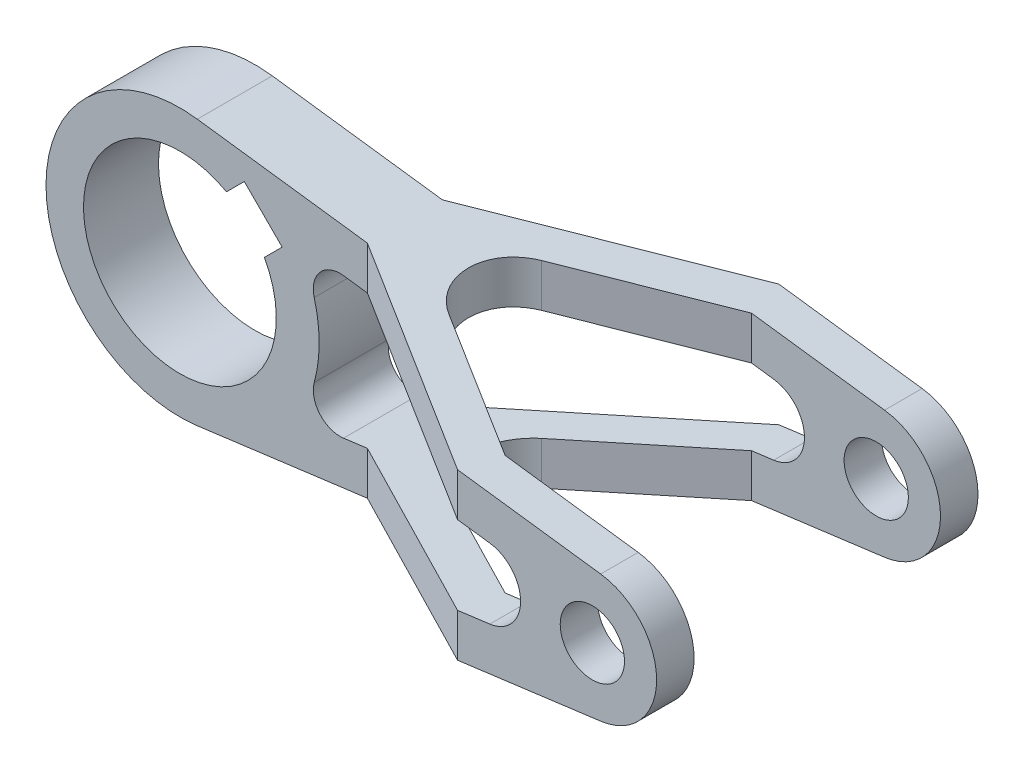
ISO-10303-21;
HEADER;
FILE_DESCRIPTION(('STEP AP214'),'2;1');
FILE_NAME('part.step','',(''),(''),'','','');
FILE_SCHEMA(('AUTOMOTIVE_DESIGN { 1 0 10303 214 1 1 1 1 }'));
ENDSEC;
DATA;
#1=APPLICATION_CONTEXT('core data for automotive mechanical design processes');
#2=APPLICATION_PROTOCOL_DEFINITION('international standard','automotive_design',2000,#1);
#3=PRODUCT_CONTEXT('',#1,'mechanical');
#4=PRODUCT('Part','Part','',(#3));
#5=PRODUCT_RELATED_PRODUCT_CATEGORY('part','',(#4));
#6=PRODUCT_DEFINITION_FORMATION('','',#4);
#7=PRODUCT_DEFINITION_CONTEXT('part definition',#1,'design');
#8=PRODUCT_DEFINITION('design','',#6,#7);
#9=PRODUCT_DEFINITION_SHAPE('','',#8);
#10=(LENGTH_UNIT() NAMED_UNIT(*) SI_UNIT(.MILLI.,.METRE.));
#11=(NAMED_UNIT(*) PLANE_ANGLE_UNIT() SI_UNIT($,.RADIAN.));
#12=(NAMED_UNIT(*) SI_UNIT($,.STERADIAN.) SOLID_ANGLE_UNIT());
#13=UNCERTAINTY_MEASURE_WITH_UNIT(LENGTH_MEASURE(1.E-05),#10,'distance_accuracy_value','');
#14=(GEOMETRIC_REPRESENTATION_CONTEXT(3) GLOBAL_UNCERTAINTY_ASSIGNED_CONTEXT((#13)) GLOBAL_UNIT_ASSIGNED_CONTEXT((#10,
#11,#12)) REPRESENTATION_CONTEXT('',''));
#15=CARTESIAN_POINT('',(0.,0.,0.));
#16=DIRECTION('',(0.,0.,1.));
#17=DIRECTION('',(1.,0.,0.));
#18=AXIS2_PLACEMENT_3D('',#15,#16,#17);
#19=CARTESIAN_POINT('',(80.858,-6.54399235940875,-30.));
#20=DIRECTION('',(0.13,-0.991513993849809,0.));
#21=DIRECTION('',(0.991513993849809,0.13,0.));
#22=AXIS2_PLACEMENT_3D('',#19,#20,#21);
#23=PLANE('',#22);
#24=DIRECTION('',(0.991513993849809,0.13,0.));
#25=VECTOR('',#24,1.);
#26=CARTESIAN_POINT('',(80.858,-6.54399235940875,-7.));
#27=LINE('',#26,#25);
#28=CARTESIAN_POINT('',(30.5506545443114,-13.1399203541781,-7.));
#29=VERTEX_POINT('',#28);
#30=CARTESIAN_POINT('',(35.,-12.5565550029805,-7.00000000000001));
#31=VERTEX_POINT('',#30);
#32=EDGE_CURVE('E457',#29,#31,#27,.T.);
#33=ORIENTED_EDGE('',*,*,#32,.F.);
#34=DIRECTION('',(0.,0.,1.));
#35=VECTOR('',#34,1.);
#36=CARTESIAN_POINT('',(30.5506545443114,-13.1399203541781,-30.));
#37=LINE('',#36,#35);
#38=CARTESIAN_POINT('',(30.5506545443114,-13.1399203541781,7.));
#39=VERTEX_POINT('',#38);
#40=EDGE_CURVE('E372',#29,#39,#37,.T.);
#41=ORIENTED_EDGE('',*,*,#40,.T.);
#42=DIRECTION('',(-0.991513993849809,-0.13,0.));
#43=VECTOR('',#42,1.);
#44=CARTESIAN_POINT('',(80.858,-6.54399235940875,7.));
#45=LINE('',#44,#43);
#46=CARTESIAN_POINT('',(35.,-12.5565550029805,7.));
#47=VERTEX_POINT('',#46);
#48=EDGE_CURVE('E443',#47,#39,#45,.T.);
#49=ORIENTED_EDGE('',*,*,#48,.F.);
#50=DIRECTION('',(-0.860496028858502,-0.112821891012615,-0.496807613898062));
#51=VECTOR('',#50,1.);
#52=CARTESIAN_POINT('',(53.7218928698561,-10.1018785302549,17.8090898881508));
#53=LINE('',#52,#51);
#54=CARTESIAN_POINT('',(74.837168574084,-7.33339935741793,30.));
#55=VERTEX_POINT('',#54);
#56=EDGE_CURVE('E274',#55,#47,#53,.T.);
#57=ORIENTED_EDGE('',*,*,#56,.F.);
#58=DIRECTION('',(0.991513993849809,0.13,0.));
#59=VECTOR('',#58,1.);
#60=CARTESIAN_POINT('',(80.858,-6.54399235940875,30.));
#61=LINE('',#60,#59);
#62=CARTESIAN_POINT('',(80.858,-6.54399235940875,30.));
#63=VERTEX_POINT('',#62);
#64=EDGE_CURVE('E362',#55,#63,#61,.T.);
#65=ORIENTED_EDGE('',*,*,#64,.T.);
#66=DIRECTION('',(0.,0.,1.));
#67=VECTOR('',#66,1.);
#68=CARTESIAN_POINT('',(80.858,-6.54399235940875,-30.));
#69=LINE('',#68,#67);
#70=CARTESIAN_POINT('',(80.858,-6.54399235940875,23.));
#71=VERTEX_POINT('',#70);
#72=EDGE_CURVE('E397',#71,#63,#69,.T.);
#73=ORIENTED_EDGE('',*,*,#72,.F.);
#74=DIRECTION('',(0.991513993849809,0.13,0.));
#75=VECTOR('',#74,1.);
#76=CARTESIAN_POINT('',(80.858,-6.54399235940875,23.));
#77=LINE('',#76,#75);
#78=CARTESIAN_POINT('',(76.7128129211019,-7.08747870816358,23.));
#79=VERTEX_POINT('',#78);
#80=EDGE_CURVE('E446',#79,#71,#77,.T.);
#81=ORIENTED_EDGE('',*,*,#80,.F.);
#82=DIRECTION('',(0.860496028858502,0.112821891012615,0.496807613898062));
#83=VECTOR('',#82,1.);
#84=CARTESIAN_POINT('',(57.1773421430353,-9.64882551405984,11.7211906875371));
#85=LINE('',#84,#83);
#86=CARTESIAN_POINT('',(51.8756443470178,-10.3439450159099,8.66025403784438));
#87=VERTEX_POINT('',#86);
#88=EDGE_CURVE('E448',#87,#79,#85,.T.);
#89=ORIENTED_EDGE('',*,*,#88,.F.);
#90=CARTESIAN_POINT('',(56.8756443470178,-9.68838190330452,0.));
#91=DIRECTION('',(0.13,-0.991513993849809,0.));
#92=DIRECTION('',(-0.991513993849809,-0.13,0.));
#93=AXIS2_PLACEMENT_3D('',#90,#91,#92);
#94=ELLIPSE('',#93,10.0855863477755,10.);
#95=CARTESIAN_POINT('',(51.8756443470178,-10.3439450159099,-8.66025403784438));
#96=VERTEX_POINT('',#95);
#97=EDGE_CURVE('E469',#87,#96,#94,.T.);
#98=ORIENTED_EDGE('',*,*,#97,.T.);
#99=DIRECTION('',(-0.860496028858502,-0.112821891012615,0.496807613898062));
#100=VECTOR('',#99,1.);
#101=CARTESIAN_POINT('',(82.8274008749923,-6.28577904589319,-26.5302590011623));
#102=LINE('',#101,#100);
#103=CARTESIAN_POINT('',(76.7128129211019,-7.08747870816358,-23.));
#104=VERTEX_POINT('',#103);
#105=EDGE_CURVE('E450',#104,#96,#102,.T.);
#106=ORIENTED_EDGE('',*,*,#105,.F.);
#107=DIRECTION('',(-0.991513993849809,-0.13,0.));
#108=VECTOR('',#107,1.);
#109=CARTESIAN_POINT('',(80.858,-6.54399235940875,-23.));
#110=LINE('',#109,#108);
#111=CARTESIAN_POINT('',(80.858,-6.54399235940875,-23.));
#112=VERTEX_POINT('',#111);
#113=EDGE_CURVE('E453',#112,#104,#110,.T.);
#114=ORIENTED_EDGE('',*,*,#113,.F.);
#115=CARTESIAN_POINT('',(80.858,-6.54399235940874,-30.));
#116=VERTEX_POINT('',#115);
#117=EDGE_CURVE('E394',#116,#112,#69,.T.);
#118=ORIENTED_EDGE('',*,*,#117,.F.);
#119=DIRECTION('',(0.991513993849809,0.13,0.));
#120=VECTOR('',#119,1.);
#121=CARTESIAN_POINT('',(80.858,-6.54399235940875,-30.));
#122=LINE('',#121,#120);
#123=CARTESIAN_POINT('',(74.837168574084,-7.33339935741793,-30.));
#124=VERTEX_POINT('',#123);
#125=EDGE_CURVE('E363',#124,#116,#122,.T.);
#126=ORIENTED_EDGE('',*,*,#125,.F.);
#127=DIRECTION('',(0.860496028858502,0.112821891012615,-0.496807613898062));
#128=VECTOR('',#127,1.);
#129=CARTESIAN_POINT('',(79.3719516018132,-6.73883206208828,-32.618158201776));
#130=LINE('',#129,#128);
#131=EDGE_CURVE('E455',#31,#124,#130,.T.);
#132=ORIENTED_EDGE('',*,*,#131,.F.);
#133=EDGE_LOOP('',(#33,#41,#49,#57,#65,#73,#81,#89,#98,#106,#114,#118,#126,#132));
#134=FACE_BOUND('',#133,.T.);
#135=ADVANCED_FACE('F37',(#134),#23,.F.);
#136=CARTESIAN_POINT('',(80.,0.,-30.));
#137=DIRECTION('',(0.,0.,1.));
#138=DIRECTION('',(1.,0.,0.));
#139=AXIS2_PLACEMENT_3D('',#136,#137,#138);
#140=CYLINDRICAL_SURFACE('',#139,6.6);
#141=CARTESIAN_POINT('',(80.,0.,23.));
#142=DIRECTION('',(0.,0.,-1.));
#143=DIRECTION('',(-1.,0.,0.));
#144=AXIS2_PLACEMENT_3D('',#141,#142,#143);
#145=CIRCLE('',#144,6.6);
#146=CARTESIAN_POINT('',(80.858,6.54399235940875,23.));
#147=VERTEX_POINT('',#146);
#148=EDGE_CURVE('E284',#71,#147,#145,.F.);
#149=ORIENTED_EDGE('',*,*,#148,.F.);
#150=ORIENTED_EDGE('',*,*,#72,.T.);
#151=CARTESIAN_POINT('',(80.,0.,30.));
#152=DIRECTION('',(0.,0.,1.));
#153=DIRECTION('',(1.,0.,0.));
#154=AXIS2_PLACEMENT_3D('',#151,#152,#153);
#155=CIRCLE('',#154,6.6);
#156=CARTESIAN_POINT('',(80.858,6.54399235940875,30.));
#157=VERTEX_POINT('',#156);
#158=EDGE_CURVE('E375',#63,#157,#155,.T.);
#159=ORIENTED_EDGE('',*,*,#158,.T.);
#160=DIRECTION('',(0.,0.,1.));
#161=VECTOR('',#160,1.);
#162=CARTESIAN_POINT('',(80.858,6.54399235940875,-30.));
#163=LINE('',#162,#161);
#164=EDGE_CURVE('E393',#147,#157,#163,.T.);
#165=ORIENTED_EDGE('',*,*,#164,.F.);
#166=EDGE_LOOP('',(#149,#150,#159,#165));
#167=FACE_BOUND('',#166,.T.);
#168=ADVANCED_FACE('F556',(#167),#140,.F.);
#169=CARTESIAN_POINT('',(80.,0.,-23.));
#170=DIRECTION('',(0.,0.,1.));
#171=DIRECTION('',(1.,0.,0.));
#172=AXIS2_PLACEMENT_3D('',#169,#170,#171);
#173=CIRCLE('',#172,6.6);
#174=CARTESIAN_POINT('',(80.858,6.54399235940875,-23.));
#175=VERTEX_POINT('',#174);
#176=EDGE_CURVE('E317',#175,#112,#173,.F.);
#177=ORIENTED_EDGE('',*,*,#176,.F.);
#178=CARTESIAN_POINT('',(80.858,6.54399235940875,-30.));
#179=VERTEX_POINT('',#178);
#180=EDGE_CURVE('E390',#179,#175,#163,.T.);
#181=ORIENTED_EDGE('',*,*,#180,.F.);
#182=CARTESIAN_POINT('',(80.,0.,-30.));
#183=DIRECTION('',(0.,0.,1.));
#184=DIRECTION('',(1.,0.,0.));
#185=AXIS2_PLACEMENT_3D('',#182,#183,#184);
#186=CIRCLE('',#185,6.6);
#187=EDGE_CURVE('E365',#116,#179,#186,.T.);
#188=ORIENTED_EDGE('',*,*,#187,.F.);
#189=ORIENTED_EDGE('',*,*,#117,.T.);
#190=EDGE_LOOP('',(#177,#181,#188,#189));
#191=FACE_BOUND('',#190,.T.);
#192=ADVANCED_FACE('F604',(#191),#140,.F.);
#193=CARTESIAN_POINT('',(80.858,6.54399235940875,-30.));
#194=DIRECTION('',(0.13,0.991513993849809,0.));
#195=DIRECTION('',(-0.991513993849809,0.13,0.));
#196=AXIS2_PLACEMENT_3D('',#193,#194,#195);
#197=PLANE('',#196);
#198=DIRECTION('',(-0.991513993849809,0.13,0.));
#199=VECTOR('',#198,1.);
#200=CARTESIAN_POINT('',(80.858,6.54399235940875,-7.));
#201=LINE('',#200,#199);
#202=CARTESIAN_POINT('',(35.,12.5565550029805,-7.));
#203=VERTEX_POINT('',#202);
#204=CARTESIAN_POINT('',(30.5506545443114,13.1399203541781,-7.));
#205=VERTEX_POINT('',#204);
#206=EDGE_CURVE('E342',#203,#205,#201,.T.);
#207=ORIENTED_EDGE('',*,*,#206,.F.);
#208=DIRECTION('',(-0.860496028858502,0.112821891012614,0.496807613898062));
#209=VECTOR('',#208,1.);
#210=CARTESIAN_POINT('',(79.3719516018132,6.73883206208828,-32.618158201776));
#211=LINE('',#210,#209);
#212=CARTESIAN_POINT('',(74.837168574084,7.33339935741793,-30.));
#213=VERTEX_POINT('',#212);
#214=EDGE_CURVE('E330',#213,#203,#211,.T.);
#215=ORIENTED_EDGE('',*,*,#214,.F.);
#216=DIRECTION('',(-0.991513993849809,0.13,0.));
#217=VECTOR('',#216,1.);
#218=CARTESIAN_POINT('',(80.858,6.54399235940875,-30.));
#219=LINE('',#218,#217);
#220=EDGE_CURVE('E369',#179,#213,#219,.T.);
#221=ORIENTED_EDGE('',*,*,#220,.F.);
#222=ORIENTED_EDGE('',*,*,#180,.T.);
#223=DIRECTION('',(0.991513993849809,-0.13,0.));
#224=VECTOR('',#223,1.);
#225=CARTESIAN_POINT('',(80.858,6.54399235940875,-23.));
#226=LINE('',#225,#224);
#227=CARTESIAN_POINT('',(76.7128129211019,7.08747870816357,-23.));
#228=VERTEX_POINT('',#227);
#229=EDGE_CURVE('E319',#228,#175,#226,.T.);
#230=ORIENTED_EDGE('',*,*,#229,.F.);
#231=DIRECTION('',(0.860496028858502,-0.112821891012614,-0.496807613898062));
#232=VECTOR('',#231,1.);
#233=CARTESIAN_POINT('',(82.8274008749923,6.28577904589319,-26.5302590011623));
#234=LINE('',#233,#232);
#235=CARTESIAN_POINT('',(51.8756443470178,10.3439450159099,-8.66025403784438));
#236=VERTEX_POINT('',#235);
#237=EDGE_CURVE('E311',#236,#228,#234,.T.);
#238=ORIENTED_EDGE('',*,*,#237,.F.);
#239=CARTESIAN_POINT('',(56.8756443470178,9.68838190330451,0.));
#240=DIRECTION('',(0.13,0.991513993849809,0.));
#241=DIRECTION('',(0.991513993849809,-0.13,0.));
#242=AXIS2_PLACEMENT_3D('',#239,#240,#241);
#243=ELLIPSE('',#242,10.0855863477755,10.);
#244=CARTESIAN_POINT('',(51.8756443470178,10.3439450159099,8.66025403784438));
#245=VERTEX_POINT('',#244);
#246=EDGE_CURVE('E12',#236,#245,#243,.T.);
#247=ORIENTED_EDGE('',*,*,#246,.T.);
#248=DIRECTION('',(-0.860496028858502,0.112821891012614,-0.496807613898062));
#249=VECTOR('',#248,1.);
#250=CARTESIAN_POINT('',(57.1773421430353,9.64882551405984,11.7211906875371));
#251=LINE('',#250,#249);
#252=CARTESIAN_POINT('',(76.7128129211019,7.08747870816358,23.));
#253=VERTEX_POINT('',#252);
#254=EDGE_CURVE('E303',#253,#245,#251,.T.);
#255=ORIENTED_EDGE('',*,*,#254,.F.);
#256=DIRECTION('',(-0.991513993849809,0.13,0.));
#257=VECTOR('',#256,1.);
#258=CARTESIAN_POINT('',(80.858,6.54399235940875,23.));
#259=LINE('',#258,#257);
#260=EDGE_CURVE('E287',#147,#253,#259,.T.);
#261=ORIENTED_EDGE('',*,*,#260,.F.);
#262=ORIENTED_EDGE('',*,*,#164,.T.);
#263=DIRECTION('',(-0.991513993849809,0.13,0.));
#264=VECTOR('',#263,1.);
#265=CARTESIAN_POINT('',(80.858,6.54399235940875,30.));
#266=LINE('',#265,#264);
#267=CARTESIAN_POINT('',(74.837168574084,7.33339935741793,30.));
#268=VERTEX_POINT('',#267);
#269=EDGE_CURVE('E366',#157,#268,#266,.T.);
#270=ORIENTED_EDGE('',*,*,#269,.T.);
#271=DIRECTION('',(0.860496028858502,-0.112821891012614,0.496807613898062));
#272=VECTOR('',#271,1.);
#273=CARTESIAN_POINT('',(53.7218928698561,10.1018785302549,17.8090898881508));
#274=LINE('',#273,#272);
#275=CARTESIAN_POINT('',(35.,12.5565550029805,7.));
#276=VERTEX_POINT('',#275);
#277=EDGE_CURVE('E267',#276,#268,#274,.T.);
#278=ORIENTED_EDGE('',*,*,#277,.F.);
#279=DIRECTION('',(0.991513993849809,-0.13,0.));
#280=VECTOR('',#279,1.);
#281=CARTESIAN_POINT('',(80.858,6.54399235940875,7.));
#282=LINE('',#281,#280);
#283=CARTESIAN_POINT('',(30.5506545443114,13.1399203541781,7.));
#284=VERTEX_POINT('',#283);
#285=EDGE_CURVE('E520',#284,#276,#282,.T.);
#286=ORIENTED_EDGE('',*,*,#285,.F.);
#287=DIRECTION('',(0.,0.,1.));
#288=VECTOR('',#287,1.);
#289=CARTESIAN_POINT('',(30.5506545443114,13.1399203541781,-30.));
#290=LINE('',#289,#288);
#291=EDGE_CURVE('E387',#205,#284,#290,.T.);
#292=ORIENTED_EDGE('',*,*,#291,.F.);
#293=EDGE_LOOP('',(#207,#215,#221,#222,#230,#238,#247,#255,#261,#262,#270,#278,#286,#292));
#294=FACE_BOUND('',#293,.T.);
#295=ADVANCED_FACE('F550',(#294),#197,.F.);
#296=CARTESIAN_POINT('',(29.9006545443114,8.18235038492903,-30.));
#297=DIRECTION('',(0.,0.,1.));
#298=DIRECTION('',(1.,0.,0.));
#299=AXIS2_PLACEMENT_3D('',#296,#297,#298);
#300=CYLINDRICAL_SURFACE('',#299,5.);
#301=CARTESIAN_POINT('',(29.9006545443114,8.18235038492903,-7.));
#302=DIRECTION('',(0.,0.,-1.));
#303=DIRECTION('',(-1.,0.,0.));
#304=AXIS2_PLACEMENT_3D('',#301,#302,#303);
#305=CIRCLE('',#304,5.);
#306=CARTESIAN_POINT('',(25.077968327487,6.86261645187597,-7.));
#307=VERTEX_POINT('',#306);
#308=EDGE_CURVE('E340',#205,#307,#305,.F.);
#309=ORIENTED_EDGE('',*,*,#308,.F.);
#310=ORIENTED_EDGE('',*,*,#291,.T.);
#311=CARTESIAN_POINT('',(29.9006545443114,8.18235038492903,7.));
#312=DIRECTION('',(0.,0.,1.));
#313=DIRECTION('',(1.,0.,0.));
#314=AXIS2_PLACEMENT_3D('',#311,#312,#313);
#315=CIRCLE('',#314,5.);
#316=CARTESIAN_POINT('',(25.077968327487,6.86261645187597,7.));
#317=VERTEX_POINT('',#316);
#318=EDGE_CURVE('E518',#317,#284,#315,.F.);
#319=ORIENTED_EDGE('',*,*,#318,.F.);
#320=DIRECTION('',(0.,0.,1.));
#321=VECTOR('',#320,1.);
#322=CARTESIAN_POINT('',(25.077968327487,6.86261645187597,-30.));
#323=LINE('',#322,#321);
#324=EDGE_CURVE('E384',#307,#317,#323,.T.);
#325=ORIENTED_EDGE('',*,*,#324,.F.);
#326=EDGE_LOOP('',(#309,#310,#319,#325));
#327=FACE_BOUND('',#326,.T.);
#328=ADVANCED_FACE('F573',(#327),#300,.F.);
#329=CARTESIAN_POINT('',(0.,0.,-30.));
#330=DIRECTION('',(0.,0.,1.));
#331=DIRECTION('',(1.,0.,0.));
#332=AXIS2_PLACEMENT_3D('',#329,#330,#331);
#333=CYLINDRICAL_SURFACE('',#332,26.);
#334=CARTESIAN_POINT('',(0.,0.,-7.));
#335=DIRECTION('',(0.,0.,-1.));
#336=DIRECTION('',(-1.,0.,0.));
#337=AXIS2_PLACEMENT_3D('',#334,#335,#336);
#338=CIRCLE('',#337,26.);
#339=CARTESIAN_POINT('',(25.077968327487,-6.86261645187597,-7.));
#340=VERTEX_POINT('',#339);
#341=EDGE_CURVE('E338',#307,#340,#338,.T.);
#342=ORIENTED_EDGE('',*,*,#341,.F.);
#343=ORIENTED_EDGE('',*,*,#324,.T.);
#344=CARTESIAN_POINT('',(0.,0.,7.));
#345=DIRECTION('',(0.,0.,1.));
#346=DIRECTION('',(1.,0.,0.));
#347=AXIS2_PLACEMENT_3D('',#344,#345,#346);
#348=CIRCLE('',#347,26.);
#349=CARTESIAN_POINT('',(25.077968327487,-6.86261645187597,7.));
#350=VERTEX_POINT('',#349);
#351=EDGE_CURVE('E515',#350,#317,#348,.T.);
#352=ORIENTED_EDGE('',*,*,#351,.F.);
#353=DIRECTION('',(0.,0.,1.));
#354=VECTOR('',#353,1.);
#355=CARTESIAN_POINT('',(25.077968327487,-6.86261645187597,-30.));
#356=LINE('',#355,#354);
#357=EDGE_CURVE('E380',#340,#350,#356,.T.);
#358=ORIENTED_EDGE('',*,*,#357,.F.);
#359=EDGE_LOOP('',(#342,#343,#352,#358));
#360=FACE_BOUND('',#359,.T.);
#361=ADVANCED_FACE('F568',(#360),#333,.T.);
#362=CARTESIAN_POINT('',(29.9006545443114,-8.18235038492904,-30.));
#363=DIRECTION('',(0.,0.,1.));
#364=DIRECTION('',(1.,0.,0.));
#365=AXIS2_PLACEMENT_3D('',#362,#363,#364);
#366=CYLINDRICAL_SURFACE('',#365,5.);
#367=CARTESIAN_POINT('',(29.9006545443114,-8.18235038492904,-7.));
#368=DIRECTION('',(0.,0.,-1.));
#369=DIRECTION('',(-1.,0.,0.));
#370=AXIS2_PLACEMENT_3D('',#367,#368,#369);
#371=CIRCLE('',#370,5.);
#372=EDGE_CURVE('E336',#340,#29,#371,.F.);
#373=ORIENTED_EDGE('',*,*,#372,.F.);
#374=ORIENTED_EDGE('',*,*,#357,.T.);
#375=CARTESIAN_POINT('',(29.9006545443114,-8.18235038492904,7.));
#376=DIRECTION('',(0.,0.,1.));
#377=DIRECTION('',(1.,0.,0.));
#378=AXIS2_PLACEMENT_3D('',#375,#376,#377);
#379=CIRCLE('',#378,5.);
#380=EDGE_CURVE('E513',#39,#350,#379,.F.);
#381=ORIENTED_EDGE('',*,*,#380,.F.);
#382=ORIENTED_EDGE('',*,*,#40,.F.);
#383=EDGE_LOOP('',(#373,#374,#381,#382));
#384=FACE_BOUND('',#383,.T.);
#385=ADVANCED_FACE('F564',(#384),#366,.F.);
#386=CARTESIAN_POINT('',(3.25,24.7878498462452,30.));
#387=DIRECTION('',(-0.13,-0.991513993849809,0.));
#388=DIRECTION('',(0.99151399384981,-0.13,0.));
#389=AXIS2_PLACEMENT_3D('',#386,#387,#388);
#390=PLANE('',#389);
#391=DIRECTION('',(0.99151399384981,-0.13,0.));
#392=VECTOR('',#391,1.);
#393=CARTESIAN_POINT('',(3.25,24.7878498462452,-7.));
#394=LINE('',#393,#392);
#395=CARTESIAN_POINT('',(3.25,24.7878498462452,-7.));
#396=VERTEX_POINT('',#395);
#397=CARTESIAN_POINT('',(35.,20.6250240812009,-7.));
#398=VERTEX_POINT('',#397);
#399=EDGE_CURVE('E356',#396,#398,#394,.T.);
#400=ORIENTED_EDGE('',*,*,#399,.F.);
#401=DIRECTION('',(0.,0.,-1.));
#402=VECTOR('',#401,1.);
#403=CARTESIAN_POINT('',(3.25,24.7878498462452,30.));
#404=LINE('',#403,#402);
#405=CARTESIAN_POINT('',(3.25,24.7878498462452,7.));
#406=VERTEX_POINT('',#405);
#407=EDGE_CURVE('E425',#406,#396,#404,.T.);
#408=ORIENTED_EDGE('',*,*,#407,.F.);
#409=DIRECTION('',(-0.99151399384981,0.13,0.));
#410=VECTOR('',#409,1.);
#411=CARTESIAN_POINT('',(3.25,24.7878498462452,7.));
#412=LINE('',#411,#410);
#413=CARTESIAN_POINT('',(35.,20.6250240812009,7.));
#414=VERTEX_POINT('',#413);
#415=EDGE_CURVE('E534',#414,#406,#412,.T.);
#416=ORIENTED_EDGE('',*,*,#415,.F.);
#417=DIRECTION('',(-0.860496028858502,0.112821891012614,-0.496807613898062));
#418=VECTOR('',#417,1.);
#419=CARTESIAN_POINT('',(20.9189878298768,22.471222514577,-1.12967616688304));
#420=LINE('',#419,#418);
#421=CARTESIAN_POINT('',(74.837168574084,15.4018684356383,30.));
#422=VERTEX_POINT('',#421);
#423=EDGE_CURVE('E285',#422,#414,#420,.T.);
#424=ORIENTED_EDGE('',*,*,#423,.F.);
#425=DIRECTION('',(-0.991513993849809,0.13,0.));
#426=VECTOR('',#425,1.);
#427=CARTESIAN_POINT('',(3.25,24.7878498462452,30.));
#428=LINE('',#427,#426);
#429=CARTESIAN_POINT('',(101.56,11.8981679261977,30.));
#430=VERTEX_POINT('',#429);
#431=EDGE_CURVE('E422',#430,#422,#428,.T.);
#432=ORIENTED_EDGE('',*,*,#431,.F.);
#433=DIRECTION('',(0.,0.,-1.));
#434=VECTOR('',#433,1.);
#435=CARTESIAN_POINT('',(101.56,11.8981679261977,30.));
#436=LINE('',#435,#434);
#437=CARTESIAN_POINT('',(101.56,11.8981679261977,23.));
#438=VERTEX_POINT('',#437);
#439=EDGE_CURVE('E434',#430,#438,#436,.T.);
#440=ORIENTED_EDGE('',*,*,#439,.T.);
#441=DIRECTION('',(0.99151399384981,-0.13,0.));
#442=VECTOR('',#441,1.);
#443=CARTESIAN_POINT('',(3.25,24.7878498462452,23.));
#444=LINE('',#443,#442);
#445=CARTESIAN_POINT('',(76.7128129211019,15.155947786384,23.));
#446=VERTEX_POINT('',#445);
#447=EDGE_CURVE('E296',#446,#438,#444,.T.);
#448=ORIENTED_EDGE('',*,*,#447,.F.);
#449=DIRECTION('',(0.860496028858502,-0.112821891012614,0.496807613898062));
#450=VECTOR('',#449,1.);
#451=CARTESIAN_POINT('',(24.374437103056,22.0181694983819,-7.21757536749671));
#452=LINE('',#451,#450);
#453=CARTESIAN_POINT('',(51.8756443470178,18.4124140941303,8.66025403784438));
#454=VERTEX_POINT('',#453);
#455=EDGE_CURVE('E306',#454,#446,#452,.T.);
#456=ORIENTED_EDGE('',*,*,#455,.F.);
#457=CARTESIAN_POINT('',(56.8756443470178,17.7568509815249,0.));
#458=DIRECTION('',(-0.13,-0.991513993849809,0.));
#459=DIRECTION('',(0.99151399384981,-0.13,0.));
#460=AXIS2_PLACEMENT_3D('',#457,#458,#459);
#461=ELLIPSE('',#460,10.0855863477755,10.);
#462=CARTESIAN_POINT('',(51.8756443470178,18.4124140941303,-8.66025403784439));
#463=VERTEX_POINT('',#462);
#464=EDGE_CURVE('E45',#454,#463,#461,.T.);
#465=ORIENTED_EDGE('',*,*,#464,.T.);
#466=DIRECTION('',(-0.860496028858502,0.112821891012614,0.496807613898062));
#467=VECTOR('',#466,1.);
#468=CARTESIAN_POINT('',(-1.27562162890099,25.3812159665486,22.0266436811219));
#469=LINE('',#468,#467);
#470=CARTESIAN_POINT('',(76.7128129211019,15.155947786384,-23.));
#471=VERTEX_POINT('',#470);
#472=EDGE_CURVE('E313',#471,#463,#469,.T.);
#473=ORIENTED_EDGE('',*,*,#472,.F.);
#474=DIRECTION('',(-0.99151399384981,0.13,0.));
#475=VECTOR('',#474,1.);
#476=CARTESIAN_POINT('',(3.24999999999999,24.7878498462452,-23.));
#477=LINE('',#476,#475);
#478=CARTESIAN_POINT('',(101.56,11.8981679261977,-23.));
#479=VERTEX_POINT('',#478);
#480=EDGE_CURVE('E324',#479,#471,#477,.T.);
#481=ORIENTED_EDGE('',*,*,#480,.F.);
#482=CARTESIAN_POINT('',(101.56,11.8981679261977,-30.));
#483=VERTEX_POINT('',#482);
#484=EDGE_CURVE('E433',#479,#483,#436,.T.);
#485=ORIENTED_EDGE('',*,*,#484,.T.);
#486=DIRECTION('',(-0.991513993849809,0.13,0.));
#487=VECTOR('',#486,1.);
#488=CARTESIAN_POINT('',(3.25,24.7878498462452,-30.));
#489=LINE('',#488,#487);
#490=CARTESIAN_POINT('',(74.837168574084,15.4018684356383,-30.));
#491=VERTEX_POINT('',#490);
#492=EDGE_CURVE('E420',#483,#491,#489,.T.);
#493=ORIENTED_EDGE('',*,*,#492,.T.);
#494=DIRECTION('',(0.860496028858502,-0.112821891012614,-0.496807613898062));
#495=VECTOR('',#494,1.);
#496=CARTESIAN_POINT('',(-4.73107090208019,25.8342689827437,15.9387444805082));
#497=LINE('',#496,#495);
#498=EDGE_CURVE('E332',#398,#491,#497,.T.);
#499=ORIENTED_EDGE('',*,*,#498,.F.);
#500=EDGE_LOOP('',(#400,#408,#416,#424,#432,#440,#448,#456,#465,#473,#481,#485,#493,#499));
#501=FACE_BOUND('',#500,.T.);
#502=ADVANCED_FACE('F579',(#501),#390,.F.);
#503=CARTESIAN_POINT('',(100.,0.,30.));
#504=DIRECTION('',(0.,0.,-1.));
#505=DIRECTION('',(-1.,0.,0.));
#506=AXIS2_PLACEMENT_3D('',#503,#504,#505);
#507=CYLINDRICAL_SURFACE('',#506,12.);
#508=CARTESIAN_POINT('',(100.,0.,23.));
#509=DIRECTION('',(0.,0.,-1.));
#510=DIRECTION('',(-1.,0.,0.));
#511=AXIS2_PLACEMENT_3D('',#508,#509,#510);
#512=CIRCLE('',#511,12.);
#513=CARTESIAN_POINT('',(101.56,-11.8981679261977,23.));
#514=VERTEX_POINT('',#513);
#515=EDGE_CURVE('E299',#438,#514,#512,.T.);
#516=ORIENTED_EDGE('',*,*,#515,.F.);
#517=ORIENTED_EDGE('',*,*,#439,.F.);
#518=CARTESIAN_POINT('',(100.,0.,30.));
#519=DIRECTION('',(0.,0.,1.));
#520=DIRECTION('',(1.,0.,0.));
#521=AXIS2_PLACEMENT_3D('',#518,#519,#520);
#522=CIRCLE('',#521,12.);
#523=CARTESIAN_POINT('',(101.56,-11.8981679261977,30.));
#524=VERTEX_POINT('',#523);
#525=EDGE_CURVE('E419',#524,#430,#522,.T.);
#526=ORIENTED_EDGE('',*,*,#525,.F.);
#527=DIRECTION('',(0.,0.,-1.));
#528=VECTOR('',#527,1.);
#529=CARTESIAN_POINT('',(101.56,-11.8981679261977,30.));
#530=LINE('',#529,#528);
#531=EDGE_CURVE('E438',#524,#514,#530,.T.);
#532=ORIENTED_EDGE('',*,*,#531,.T.);
#533=EDGE_LOOP('',(#516,#517,#526,#532));
#534=FACE_BOUND('',#533,.T.);
#535=ADVANCED_FACE('F632',(#534),#507,.T.);
#536=ORIENTED_EDGE('',*,*,#484,.F.);
#537=CARTESIAN_POINT('',(100.,0.,-23.));
#538=DIRECTION('',(0.,0.,1.));
#539=DIRECTION('',(1.,0.,0.));
#540=AXIS2_PLACEMENT_3D('',#537,#538,#539);
#541=CIRCLE('',#540,12.);
#542=CARTESIAN_POINT('',(101.56,-11.8981679261977,-23.));
#543=VERTEX_POINT('',#542);
#544=EDGE_CURVE('E326',#543,#479,#541,.T.);
#545=ORIENTED_EDGE('',*,*,#544,.F.);
#546=CARTESIAN_POINT('',(101.56,-11.8981679261977,-30.));
#547=VERTEX_POINT('',#546);
#548=EDGE_CURVE('E437',#543,#547,#530,.T.);
#549=ORIENTED_EDGE('',*,*,#548,.T.);
#550=CARTESIAN_POINT('',(100.,0.,-30.));
#551=DIRECTION('',(0.,0.,1.));
#552=DIRECTION('',(1.,0.,0.));
#553=AXIS2_PLACEMENT_3D('',#550,#551,#552);
#554=CIRCLE('',#553,12.);
#555=EDGE_CURVE('E427',#547,#483,#554,.T.);
#556=ORIENTED_EDGE('',*,*,#555,.T.);
#557=EDGE_LOOP('',(#536,#545,#549,#556));
#558=FACE_BOUND('',#557,.T.);
#559=ADVANCED_FACE('F614',(#558),#507,.T.);
#560=CARTESIAN_POINT('',(3.25,-24.7878498462452,30.));
#561=DIRECTION('',(-0.13,0.991513993849809,0.));
#562=DIRECTION('',(-0.99151399384981,-0.13,0.));
#563=AXIS2_PLACEMENT_3D('',#560,#561,#562);
#564=PLANE('',#563);
#565=DIRECTION('',(-0.99151399384981,-0.13,0.));
#566=VECTOR('',#565,1.);
#567=CARTESIAN_POINT('',(3.25,-24.7878498462452,-7.));
#568=LINE('',#567,#566);
#569=CARTESIAN_POINT('',(35.,-20.6250240812009,-7.));
#570=VERTEX_POINT('',#569);
#571=CARTESIAN_POINT('',(3.25,-24.7878498462452,-7.));
#572=VERTEX_POINT('',#571);
#573=EDGE_CURVE('E360',#570,#572,#568,.T.);
#574=ORIENTED_EDGE('',*,*,#573,.F.);
#575=DIRECTION('',(-0.860496028858502,-0.112821891012614,0.496807613898062));
#576=VECTOR('',#575,1.);
#577=CARTESIAN_POINT('',(-4.73107090208018,-25.8342689827437,15.9387444805082));
#578=LINE('',#577,#576);
#579=CARTESIAN_POINT('',(74.837168574084,-15.4018684356383,-30.));
#580=VERTEX_POINT('',#579);
#581=EDGE_CURVE('E334',#580,#570,#578,.T.);
#582=ORIENTED_EDGE('',*,*,#581,.F.);
#583=DIRECTION('',(0.991513993849809,0.13,0.));
#584=VECTOR('',#583,1.);
#585=CARTESIAN_POINT('',(3.25,-24.7878498462452,-30.));
#586=LINE('',#585,#584);
#587=EDGE_CURVE('E415',#580,#547,#586,.T.);
#588=ORIENTED_EDGE('',*,*,#587,.T.);
#589=ORIENTED_EDGE('',*,*,#548,.F.);
#590=DIRECTION('',(0.99151399384981,0.13,0.));
#591=VECTOR('',#590,1.);
#592=CARTESIAN_POINT('',(3.24999999999999,-24.7878498462452,-23.));
#593=LINE('',#592,#591);
#594=CARTESIAN_POINT('',(76.7128129211019,-15.155947786384,-23.));
#595=VERTEX_POINT('',#594);
#596=EDGE_CURVE('E328',#595,#543,#593,.T.);
#597=ORIENTED_EDGE('',*,*,#596,.F.);
#598=DIRECTION('',(0.860496028858502,0.112821891012614,-0.496807613898062));
#599=VECTOR('',#598,1.);
#600=CARTESIAN_POINT('',(-1.27562162890099,-25.3812159665486,22.0266436811219));
#601=LINE('',#600,#599);
#602=CARTESIAN_POINT('',(51.8756443470178,-18.4124140941303,-8.66025403784439));
#603=VERTEX_POINT('',#602);
#604=EDGE_CURVE('E315',#603,#595,#601,.T.);
#605=ORIENTED_EDGE('',*,*,#604,.F.);
#606=CARTESIAN_POINT('',(56.8756443470178,-17.7568509815249,0.));
#607=DIRECTION('',(-0.13,0.991513993849809,0.));
#608=DIRECTION('',(-0.99151399384981,-0.13,0.));
#609=AXIS2_PLACEMENT_3D('',#606,#607,#608);
#610=ELLIPSE('',#609,10.0855863477755,10.);
#611=CARTESIAN_POINT('',(51.8756443470178,-18.4124140941303,8.66025403784438));
#612=VERTEX_POINT('',#611);
#613=EDGE_CURVE('E471',#603,#612,#610,.T.);
#614=ORIENTED_EDGE('',*,*,#613,.T.);
#615=DIRECTION('',(-0.860496028858502,-0.112821891012614,-0.496807613898062));
#616=VECTOR('',#615,1.);
#617=CARTESIAN_POINT('',(24.374437103056,-22.0181694983819,-7.21757536749671));
#618=LINE('',#617,#616);
#619=CARTESIAN_POINT('',(76.7128129211019,-15.155947786384,23.));
#620=VERTEX_POINT('',#619);
#621=EDGE_CURVE('E308',#620,#612,#618,.T.);
#622=ORIENTED_EDGE('',*,*,#621,.F.);
#623=DIRECTION('',(-0.99151399384981,-0.13,0.));
#624=VECTOR('',#623,1.);
#625=CARTESIAN_POINT('',(3.25,-24.7878498462452,23.));
#626=LINE('',#625,#624);
#627=EDGE_CURVE('E301',#514,#620,#626,.T.);
#628=ORIENTED_EDGE('',*,*,#627,.F.);
#629=ORIENTED_EDGE('',*,*,#531,.F.);
#630=DIRECTION('',(0.991513993849809,0.13,0.));
#631=VECTOR('',#630,1.);
#632=CARTESIAN_POINT('',(3.25,-24.7878498462452,30.));
#633=LINE('',#632,#631);
#634=CARTESIAN_POINT('',(74.837168574084,-15.4018684356383,30.));
#635=VERTEX_POINT('',#634);
#636=EDGE_CURVE('E283',#635,#524,#633,.T.);
#637=ORIENTED_EDGE('',*,*,#636,.F.);
#638=DIRECTION('',(0.860496028858502,0.112821891012614,0.496807613898062));
#639=VECTOR('',#638,1.);
#640=CARTESIAN_POINT('',(20.9189878298768,-22.471222514577,-1.12967616688304));
#641=LINE('',#640,#639);
#642=CARTESIAN_POINT('',(35.,-20.6250240812009,7.));
#643=VERTEX_POINT('',#642);
#644=EDGE_CURVE('E271',#643,#635,#641,.T.);
#645=ORIENTED_EDGE('',*,*,#644,.F.);
#646=DIRECTION('',(0.99151399384981,0.13,0.));
#647=VECTOR('',#646,1.);
#648=CARTESIAN_POINT('',(3.25,-24.7878498462452,7.));
#649=LINE('',#648,#647);
#650=CARTESIAN_POINT('',(3.25,-24.7878498462452,7.));
#651=VERTEX_POINT('',#650);
#652=EDGE_CURVE('E256',#651,#643,#649,.T.);
#653=ORIENTED_EDGE('',*,*,#652,.F.);
#654=DIRECTION('',(0.,0.,-1.));
#655=VECTOR('',#654,1.);
#656=CARTESIAN_POINT('',(3.25,-24.7878498462452,30.));
#657=LINE('',#656,#655);
#658=EDGE_CURVE('E441',#651,#572,#657,.T.);
#659=ORIENTED_EDGE('',*,*,#658,.T.);
#660=EDGE_LOOP('',(#574,#582,#588,#589,#597,#605,#614,#622,#628,#629,#637,#645,#653,#659));
#661=FACE_BOUND('',#660,.T.);
#662=ADVANCED_FACE('F281',(#661),#564,.F.);
#663=CARTESIAN_POINT('',(0.,0.,30.));
#664=DIRECTION('',(0.,0.,-1.));
#665=DIRECTION('',(-1.,0.,0.));
#666=AXIS2_PLACEMENT_3D('',#663,#664,#665);
#667=CYLINDRICAL_SURFACE('',#666,25.);
#668=CARTESIAN_POINT('',(0.,0.,7.));
#669=DIRECTION('',(0.,0.,1.));
#670=DIRECTION('',(1.,0.,0.));
#671=AXIS2_PLACEMENT_3D('',#668,#669,#670);
#672=CIRCLE('',#671,25.);
#673=EDGE_CURVE('E262',#406,#651,#672,.T.);
#674=ORIENTED_EDGE('',*,*,#673,.F.);
#675=ORIENTED_EDGE('',*,*,#407,.T.);
#676=CARTESIAN_POINT('',(0.,0.,-7.));
#677=DIRECTION('',(0.,0.,-1.));
#678=DIRECTION('',(-1.,0.,0.));
#679=AXIS2_PLACEMENT_3D('',#676,#677,#678);
#680=CIRCLE('',#679,25.);
#681=EDGE_CURVE('E358',#572,#396,#680,.T.);
#682=ORIENTED_EDGE('',*,*,#681,.F.);
#683=ORIENTED_EDGE('',*,*,#658,.F.);
#684=EDGE_LOOP('',(#674,#675,#682,#683));
#685=FACE_BOUND('',#684,.T.);
#686=ADVANCED_FACE('F583',(#685),#667,.T.);
#687=CARTESIAN_POINT('',(100.,0.,30.));
#688=DIRECTION('',(0.,0.,-1.));
#689=DIRECTION('',(-1.,0.,0.));
#690=AXIS2_PLACEMENT_3D('',#687,#688,#689);
#691=CYLINDRICAL_SURFACE('',#690,6.);
#692=CARTESIAN_POINT('',(100.,0.,-30.));
#693=DIRECTION('',(0.,0.,1.));
#694=DIRECTION('',(1.,0.,0.));
#695=AXIS2_PLACEMENT_3D('',#692,#693,#694);
#696=CIRCLE('',#695,6.);
#697=CARTESIAN_POINT('',(106.,0.,-30.));
#698=VERTEX_POINT('',#697);
#699=EDGE_CURVE('E411',#698,#698,#696,.T.);
#700=ORIENTED_EDGE('',*,*,#699,.F.);
#701=EDGE_LOOP('',(#700));
#702=FACE_BOUND('',#701,.T.);
#703=CARTESIAN_POINT('',(100.,0.,-23.));
#704=DIRECTION('',(0.,0.,1.));
#705=DIRECTION('',(1.,0.,0.));
#706=AXIS2_PLACEMENT_3D('',#703,#704,#705);
#707=CIRCLE('',#706,6.);
#708=CARTESIAN_POINT('',(106.,0.,-23.));
#709=VERTEX_POINT('',#708);
#710=EDGE_CURVE('E321',#709,#709,#707,.T.);
#711=ORIENTED_EDGE('',*,*,#710,.T.);
#712=EDGE_LOOP('',(#711));
#713=FACE_BOUND('',#712,.T.);
#714=ADVANCED_FACE('F667',(#702,#713),#691,.F.);
#715=CARTESIAN_POINT('',(0.,0.,-30.));
#716=DIRECTION('',(0.,0.,1.));
#717=DIRECTION('',(1.,0.,0.));
#718=AXIS2_PLACEMENT_3D('',#715,#716,#717);
#719=PLANE('',#718);
#720=ORIENTED_EDGE('',*,*,#699,.T.);
#721=EDGE_LOOP('',(#720));
#722=FACE_BOUND('',#721,.T.);
#723=DIRECTION('',(0.,1.,0.));
#724=VECTOR('',#723,1.);
#725=CARTESIAN_POINT('',(74.837168574084,-25.,-30.));
#726=LINE('',#725,#724);
#727=EDGE_CURVE('E498',#213,#491,#726,.T.);
#728=ORIENTED_EDGE('',*,*,#727,.T.);
#729=ORIENTED_EDGE('',*,*,#492,.F.);
#730=ORIENTED_EDGE('',*,*,#555,.F.);
#731=ORIENTED_EDGE('',*,*,#587,.F.);
#732=EDGE_CURVE('E502',#580,#124,#726,.T.);
#733=ORIENTED_EDGE('',*,*,#732,.T.);
#734=ORIENTED_EDGE('',*,*,#125,.T.);
#735=ORIENTED_EDGE('',*,*,#187,.T.);
#736=ORIENTED_EDGE('',*,*,#220,.T.);
#737=EDGE_LOOP('',(#728,#729,#730,#731,#733,#734,#735,#736));
#738=FACE_BOUND('',#737,.T.);
#739=ADVANCED_FACE('F598',(#722,#738),#719,.F.);
#740=CARTESIAN_POINT('',(100.,0.,30.));
#741=DIRECTION('',(0.,0.,1.));
#742=DIRECTION('',(1.,0.,0.));
#743=AXIS2_PLACEMENT_3D('',#740,#741,#742);
#744=CIRCLE('',#743,6.);
#745=CARTESIAN_POINT('',(106.,0.,30.));
#746=VERTEX_POINT('',#745);
#747=EDGE_CURVE('E412',#746,#746,#744,.T.);
#748=ORIENTED_EDGE('',*,*,#747,.T.);
#749=EDGE_LOOP('',(#748));
#750=FACE_BOUND('',#749,.T.);
#751=CARTESIAN_POINT('',(100.,0.,23.));
#752=DIRECTION('',(0.,0.,-1.));
#753=DIRECTION('',(-1.,0.,0.));
#754=AXIS2_PLACEMENT_3D('',#751,#752,#753);
#755=CIRCLE('',#754,6.);
#756=CARTESIAN_POINT('',(94.,0.,23.));
#757=VERTEX_POINT('',#756);
#758=EDGE_CURVE('E293',#757,#757,#755,.T.);
#759=ORIENTED_EDGE('',*,*,#758,.T.);
#760=EDGE_LOOP('',(#759));
#761=FACE_BOUND('',#760,.T.);
#762=ADVANCED_FACE('F671',(#750,#761),#691,.F.);
#763=CARTESIAN_POINT('',(0.,0.,30.));
#764=DIRECTION('',(0.,0.,1.));
#765=DIRECTION('',(1.,0.,0.));
#766=AXIS2_PLACEMENT_3D('',#763,#764,#765);
#767=PLANE('',#766);
#768=ORIENTED_EDGE('',*,*,#747,.F.);
#769=EDGE_LOOP('',(#768));
#770=FACE_BOUND('',#769,.T.);
#771=ORIENTED_EDGE('',*,*,#431,.T.);
#772=DIRECTION('',(0.,1.,0.));
#773=VECTOR('',#772,1.);
#774=CARTESIAN_POINT('',(74.837168574084,-25.,30.));
#775=LINE('',#774,#773);
#776=EDGE_CURVE('E276',#268,#422,#775,.T.);
#777=ORIENTED_EDGE('',*,*,#776,.F.);
#778=ORIENTED_EDGE('',*,*,#269,.F.);
#779=ORIENTED_EDGE('',*,*,#158,.F.);
#780=ORIENTED_EDGE('',*,*,#64,.F.);
#781=EDGE_CURVE('E510',#635,#55,#775,.T.);
#782=ORIENTED_EDGE('',*,*,#781,.F.);
#783=ORIENTED_EDGE('',*,*,#636,.T.);
#784=ORIENTED_EDGE('',*,*,#525,.T.);
#785=EDGE_LOOP('',(#771,#777,#778,#779,#780,#782,#783,#784));
#786=FACE_BOUND('',#785,.T.);
#787=ADVANCED_FACE('F546',(#770,#786),#767,.T.);
#788=CARTESIAN_POINT('',(-25.,-25.,7.));
#789=DIRECTION('',(0.,0.,1.));
#790=DIRECTION('',(1.,0.,0.));
#791=AXIS2_PLACEMENT_3D('',#788,#789,#790);
#792=PLANE('',#791);
#793=DIRECTION('',(-0.707106781186551,-0.707106781186544,0.));
#794=VECTOR('',#793,1.);
#795=CARTESIAN_POINT('',(8.69148535470483,15.7625531665702,7.));
#796=LINE('',#795,#794);
#797=CARTESIAN_POINT('',(12.0208152801714,19.0918830920367,7.));
#798=VERTEX_POINT('',#797);
#799=CARTESIAN_POINT('',(8.69148535470483,15.7625531665702,7.));
#800=VERTEX_POINT('',#799);
#801=EDGE_CURVE('E522',#798,#800,#796,.T.);
#802=ORIENTED_EDGE('',*,*,#801,.F.);
#803=DIRECTION('',(-0.707106781186544,0.707106781186551,0.));
#804=VECTOR('',#803,1.);
#805=CARTESIAN_POINT('',(12.0208152801714,19.0918830920367,7.));
#806=LINE('',#805,#804);
#807=CARTESIAN_POINT('',(19.0918830920368,12.0208152801712,7.));
#808=VERTEX_POINT('',#807);
#809=EDGE_CURVE('E525',#808,#798,#806,.T.);
#810=ORIENTED_EDGE('',*,*,#809,.F.);
#811=DIRECTION('',(0.707106781186553,0.707106781186543,0.));
#812=VECTOR('',#811,1.);
#813=CARTESIAN_POINT('',(19.0918830920368,12.0208152801712,7.));
#814=LINE('',#813,#812);
#815=CARTESIAN_POINT('',(15.7625531665703,8.69148535470467,7.));
#816=VERTEX_POINT('',#815);
#817=EDGE_CURVE('E528',#816,#808,#814,.T.);
#818=ORIENTED_EDGE('',*,*,#817,.F.);
#819=CARTESIAN_POINT('',(0.,0.,7.));
#820=DIRECTION('',(0.,0.,1.));
#821=DIRECTION('',(1.,0.,0.));
#822=AXIS2_PLACEMENT_3D('',#819,#820,#821);
#823=CIRCLE('',#822,18.);
#824=EDGE_CURVE('E531',#800,#816,#823,.T.);
#825=ORIENTED_EDGE('',*,*,#824,.F.);
#826=EDGE_LOOP('',(#802,#810,#818,#825));
#827=FACE_BOUND('',#826,.T.);
#828=ORIENTED_EDGE('',*,*,#652,.T.);
#829=DIRECTION('',(0.,1.,0.));
#830=VECTOR('',#829,1.);
#831=CARTESIAN_POINT('',(35.,-25.,7.));
#832=LINE('',#831,#830);
#833=EDGE_CURVE('E259',#643,#47,#832,.T.);
#834=ORIENTED_EDGE('',*,*,#833,.T.);
#835=ORIENTED_EDGE('',*,*,#48,.T.);
#836=ORIENTED_EDGE('',*,*,#380,.T.);
#837=ORIENTED_EDGE('',*,*,#351,.T.);
#838=ORIENTED_EDGE('',*,*,#318,.T.);
#839=ORIENTED_EDGE('',*,*,#285,.T.);
#840=EDGE_CURVE('E277',#276,#414,#832,.T.);
#841=ORIENTED_EDGE('',*,*,#840,.T.);
#842=ORIENTED_EDGE('',*,*,#415,.T.);
#843=ORIENTED_EDGE('',*,*,#673,.T.);
#844=EDGE_LOOP('',(#828,#834,#835,#836,#837,#838,#839,#841,#842,#843));
#845=FACE_BOUND('',#844,.T.);
#846=ADVANCED_FACE('F258',(#827,#845),#792,.T.);
#847=CARTESIAN_POINT('',(35.,-25.,7.));
#848=DIRECTION('',(-0.500000000000001,0.,0.866025403784438));
#849=DIRECTION('',(0.866025403784438,0.,0.500000000000001));
#850=AXIS2_PLACEMENT_3D('',#847,#848,#849);
#851=PLANE('',#850);
#852=ORIENTED_EDGE('',*,*,#644,.T.);
#853=ORIENTED_EDGE('',*,*,#781,.T.);
#854=ORIENTED_EDGE('',*,*,#56,.T.);
#855=ORIENTED_EDGE('',*,*,#833,.F.);
#856=EDGE_LOOP('',(#852,#853,#854,#855));
#857=FACE_BOUND('',#856,.T.);
#858=ADVANCED_FACE('F270',(#857),#851,.T.);
#859=ORIENTED_EDGE('',*,*,#423,.T.);
#860=ORIENTED_EDGE('',*,*,#840,.F.);
#861=ORIENTED_EDGE('',*,*,#277,.T.);
#862=ORIENTED_EDGE('',*,*,#776,.T.);
#863=EDGE_LOOP('',(#859,#860,#861,#862));
#864=FACE_BOUND('',#863,.T.);
#865=ADVANCED_FACE('F540',(#864),#851,.T.);
#866=CARTESIAN_POINT('',(112.,-25.,23.));
#867=DIRECTION('',(0.,0.,-1.));
#868=DIRECTION('',(-1.,0.,0.));
#869=AXIS2_PLACEMENT_3D('',#866,#867,#868);
#870=PLANE('',#869);
#871=ORIENTED_EDGE('',*,*,#758,.F.);
#872=EDGE_LOOP('',(#871));
#873=FACE_BOUND('',#872,.T.);
#874=ORIENTED_EDGE('',*,*,#627,.T.);
#875=DIRECTION('',(0.,1.,0.));
#876=VECTOR('',#875,1.);
#877=CARTESIAN_POINT('',(76.7128129211019,-25.,23.));
#878=LINE('',#877,#876);
#879=EDGE_CURVE('E485',#620,#79,#878,.T.);
#880=ORIENTED_EDGE('',*,*,#879,.T.);
#881=ORIENTED_EDGE('',*,*,#80,.T.);
#882=ORIENTED_EDGE('',*,*,#148,.T.);
#883=ORIENTED_EDGE('',*,*,#260,.T.);
#884=EDGE_CURVE('E507',#253,#446,#878,.T.);
#885=ORIENTED_EDGE('',*,*,#884,.T.);
#886=ORIENTED_EDGE('',*,*,#447,.T.);
#887=ORIENTED_EDGE('',*,*,#515,.T.);
#888=EDGE_LOOP('',(#874,#880,#881,#882,#883,#885,#886,#887));
#889=FACE_BOUND('',#888,.T.);
#890=ADVANCED_FACE('F628',(#873,#889),#870,.T.);
#891=CARTESIAN_POINT('',(76.7128129211019,-25.,23.));
#892=DIRECTION('',(0.500000000000001,0.,-0.866025403784438));
#893=DIRECTION('',(-0.866025403784438,0.,-0.500000000000001));
#894=AXIS2_PLACEMENT_3D('',#891,#892,#893);
#895=PLANE('',#894);
#896=ORIENTED_EDGE('',*,*,#621,.T.);
#897=DIRECTION('',(0.,1.,0.));
#898=VECTOR('',#897,1.);
#899=CARTESIAN_POINT('',(51.8756443470178,-12.3106343537261,8.66025403784438));
#900=LINE('',#899,#898);
#901=EDGE_CURVE('E460',#612,#87,#900,.T.);
#902=ORIENTED_EDGE('',*,*,#901,.T.);
#903=ORIENTED_EDGE('',*,*,#88,.T.);
#904=ORIENTED_EDGE('',*,*,#879,.F.);
#905=EDGE_LOOP('',(#896,#902,#903,#904));
#906=FACE_BOUND('',#905,.T.);
#907=ADVANCED_FACE('F482',(#906),#895,.T.);
#908=CARTESIAN_POINT('',(76.7128129211019,-25.,-23.));
#909=DIRECTION('',(0.500000000000001,0.,0.866025403784438));
#910=DIRECTION('',(0.866025403784438,0.,-0.500000000000001));
#911=AXIS2_PLACEMENT_3D('',#908,#909,#910);
#912=PLANE('',#911);
#913=ORIENTED_EDGE('',*,*,#105,.T.);
#914=DIRECTION('',(0.,1.,0.));
#915=VECTOR('',#914,1.);
#916=CARTESIAN_POINT('',(51.8756443470178,-20.3791034319465,-8.66025403784438));
#917=LINE('',#916,#915);
#918=EDGE_CURVE('E463',#96,#603,#917,.F.);
#919=ORIENTED_EDGE('',*,*,#918,.T.);
#920=ORIENTED_EDGE('',*,*,#604,.T.);
#921=DIRECTION('',(0.,1.,0.));
#922=VECTOR('',#921,1.);
#923=CARTESIAN_POINT('',(76.7128129211019,-25.,-23.));
#924=LINE('',#923,#922);
#925=EDGE_CURVE('E496',#595,#104,#924,.T.);
#926=ORIENTED_EDGE('',*,*,#925,.T.);
#927=EDGE_LOOP('',(#913,#919,#920,#926));
#928=FACE_BOUND('',#927,.T.);
#929=ADVANCED_FACE('F494',(#928),#912,.T.);
#930=CARTESIAN_POINT('',(112.,-25.,-23.));
#931=DIRECTION('',(0.,0.,1.));
#932=DIRECTION('',(1.,0.,0.));
#933=AXIS2_PLACEMENT_3D('',#930,#931,#932);
#934=PLANE('',#933);
#935=ORIENTED_EDGE('',*,*,#710,.F.);
#936=EDGE_LOOP('',(#935));
#937=FACE_BOUND('',#936,.T.);
#938=ORIENTED_EDGE('',*,*,#596,.T.);
#939=ORIENTED_EDGE('',*,*,#544,.T.);
#940=ORIENTED_EDGE('',*,*,#480,.T.);
#941=EDGE_CURVE('E499',#228,#471,#924,.T.);
#942=ORIENTED_EDGE('',*,*,#941,.F.);
#943=ORIENTED_EDGE('',*,*,#229,.T.);
#944=ORIENTED_EDGE('',*,*,#176,.T.);
#945=ORIENTED_EDGE('',*,*,#113,.T.);
#946=ORIENTED_EDGE('',*,*,#925,.F.);
#947=EDGE_LOOP('',(#938,#939,#940,#942,#943,#944,#945,#946));
#948=FACE_BOUND('',#947,.T.);
#949=ADVANCED_FACE('F617',(#937,#948),#934,.T.);
#950=ORIENTED_EDGE('',*,*,#254,.T.);
#951=DIRECTION('',(0.,1.,0.));
#952=VECTOR('',#951,1.);
#953=CARTESIAN_POINT('',(51.8756443470178,20.3791034319465,8.66025403784438));
#954=LINE('',#953,#952);
#955=EDGE_CURVE('E465',#245,#454,#954,.T.);
#956=ORIENTED_EDGE('',*,*,#955,.T.);
#957=ORIENTED_EDGE('',*,*,#455,.T.);
#958=ORIENTED_EDGE('',*,*,#884,.F.);
#959=EDGE_LOOP('',(#950,#956,#957,#958));
#960=FACE_BOUND('',#959,.T.);
#961=ADVANCED_FACE('F625',(#960),#895,.T.);
#962=ORIENTED_EDGE('',*,*,#472,.T.);
#963=DIRECTION('',(0.,1.,0.));
#964=VECTOR('',#963,1.);
#965=CARTESIAN_POINT('',(51.8756443470178,12.3106343537261,-8.66025403784438));
#966=LINE('',#965,#964);
#967=EDGE_CURVE('E52',#463,#236,#966,.F.);
#968=ORIENTED_EDGE('',*,*,#967,.T.);
#969=ORIENTED_EDGE('',*,*,#237,.T.);
#970=ORIENTED_EDGE('',*,*,#941,.T.);
#971=EDGE_LOOP('',(#962,#968,#969,#970));
#972=FACE_BOUND('',#971,.T.);
#973=ADVANCED_FACE('F619',(#972),#912,.T.);
#974=CARTESIAN_POINT('',(-25.,-25.,-7.));
#975=DIRECTION('',(0.,0.,-1.));
#976=DIRECTION('',(-1.,0.,0.));
#977=AXIS2_PLACEMENT_3D('',#974,#975,#976);
#978=PLANE('',#977);
#979=DIRECTION('',(-0.707106781186553,-0.707106781186543,0.));
#980=VECTOR('',#979,1.);
#981=CARTESIAN_POINT('',(19.0918830920368,12.0208152801712,-7.));
#982=LINE('',#981,#980);
#983=CARTESIAN_POINT('',(19.0918830920368,12.0208152801712,-7.));
#984=VERTEX_POINT('',#983);
#985=CARTESIAN_POINT('',(15.7625531665703,8.69148535470467,-7.));
#986=VERTEX_POINT('',#985);
#987=EDGE_CURVE('E350',#984,#986,#982,.T.);
#988=ORIENTED_EDGE('',*,*,#987,.F.);
#989=DIRECTION('',(0.707106781186544,-0.707106781186551,0.));
#990=VECTOR('',#989,1.);
#991=CARTESIAN_POINT('',(12.0208152801714,19.0918830920367,-7.));
#992=LINE('',#991,#990);
#993=CARTESIAN_POINT('',(12.0208152801714,19.0918830920367,-7.));
#994=VERTEX_POINT('',#993);
#995=EDGE_CURVE('E347',#994,#984,#992,.T.);
#996=ORIENTED_EDGE('',*,*,#995,.F.);
#997=DIRECTION('',(0.707106781186551,0.707106781186544,0.));
#998=VECTOR('',#997,1.);
#999=CARTESIAN_POINT('',(8.69148535470483,15.7625531665702,-7.));
#1000=LINE('',#999,#998);
#1001=CARTESIAN_POINT('',(8.69148535470483,15.7625531665702,-7.));
#1002=VERTEX_POINT('',#1001);
#1003=EDGE_CURVE('E344',#1002,#994,#1000,.T.);
#1004=ORIENTED_EDGE('',*,*,#1003,.F.);
#1005=CARTESIAN_POINT('',(0.,0.,-7.));
#1006=DIRECTION('',(0.,0.,-1.));
#1007=DIRECTION('',(-1.,0.,0.));
#1008=AXIS2_PLACEMENT_3D('',#1005,#1006,#1007);
#1009=CIRCLE('',#1008,18.);
#1010=EDGE_CURVE('E353',#986,#1002,#1009,.T.);
#1011=ORIENTED_EDGE('',*,*,#1010,.F.);
#1012=EDGE_LOOP('',(#988,#996,#1004,#1011));
#1013=FACE_BOUND('',#1012,.T.);
#1014=ORIENTED_EDGE('',*,*,#573,.T.);
#1015=ORIENTED_EDGE('',*,*,#681,.T.);
#1016=ORIENTED_EDGE('',*,*,#399,.T.);
#1017=DIRECTION('',(0.,1.,0.));
#1018=VECTOR('',#1017,1.);
#1019=CARTESIAN_POINT('',(35.,-25.,-7.));
#1020=LINE('',#1019,#1018);
#1021=EDGE_CURVE('E591',#203,#398,#1020,.T.);
#1022=ORIENTED_EDGE('',*,*,#1021,.F.);
#1023=ORIENTED_EDGE('',*,*,#206,.T.);
#1024=ORIENTED_EDGE('',*,*,#308,.T.);
#1025=ORIENTED_EDGE('',*,*,#341,.T.);
#1026=ORIENTED_EDGE('',*,*,#372,.T.);
#1027=ORIENTED_EDGE('',*,*,#32,.T.);
#1028=EDGE_CURVE('E516',#570,#31,#1020,.T.);
#1029=ORIENTED_EDGE('',*,*,#1028,.F.);
#1030=EDGE_LOOP('',(#1014,#1015,#1016,#1022,#1023,#1024,#1025,#1026,#1027,#1029));
#1031=FACE_BOUND('',#1030,.T.);
#1032=ADVANCED_FACE('F588',(#1013,#1031),#978,.T.);
#1033=CARTESIAN_POINT('',(35.,-25.,-7.));
#1034=DIRECTION('',(-0.500000000000001,0.,-0.866025403784438));
#1035=DIRECTION('',(-0.866025403784438,0.,0.500000000000001));
#1036=AXIS2_PLACEMENT_3D('',#1033,#1034,#1035);
#1037=PLANE('',#1036);
#1038=ORIENTED_EDGE('',*,*,#581,.T.);
#1039=ORIENTED_EDGE('',*,*,#1028,.T.);
#1040=ORIENTED_EDGE('',*,*,#131,.T.);
#1041=ORIENTED_EDGE('',*,*,#732,.F.);
#1042=EDGE_LOOP('',(#1038,#1039,#1040,#1041));
#1043=FACE_BOUND('',#1042,.T.);
#1044=ADVANCED_FACE('F694',(#1043),#1037,.T.);
#1045=ORIENTED_EDGE('',*,*,#498,.T.);
#1046=ORIENTED_EDGE('',*,*,#727,.F.);
#1047=ORIENTED_EDGE('',*,*,#214,.T.);
#1048=ORIENTED_EDGE('',*,*,#1021,.T.);
#1049=EDGE_LOOP('',(#1045,#1046,#1047,#1048));
#1050=FACE_BOUND('',#1049,.T.);
#1051=ADVANCED_FACE('F608',(#1050),#1037,.T.);
#1052=CARTESIAN_POINT('',(0.,0.,30.));
#1053=DIRECTION('',(0.,0.,-1.));
#1054=DIRECTION('',(-1.,0.,0.));
#1055=AXIS2_PLACEMENT_3D('',#1052,#1053,#1054);
#1056=CYLINDRICAL_SURFACE('',#1055,18.);
#1057=DIRECTION('',(0.,0.,-1.));
#1058=VECTOR('',#1057,1.);
#1059=CARTESIAN_POINT('',(15.7625531665703,8.69148535470467,30.));
#1060=LINE('',#1059,#1058);
#1061=EDGE_CURVE('E408',#816,#986,#1060,.T.);
#1062=ORIENTED_EDGE('',*,*,#1061,.T.);
#1063=ORIENTED_EDGE('',*,*,#1010,.T.);
#1064=DIRECTION('',(0.,0.,-1.));
#1065=VECTOR('',#1064,1.);
#1066=CARTESIAN_POINT('',(8.69148535470483,15.7625531665702,30.));
#1067=LINE('',#1066,#1065);
#1068=EDGE_CURVE('E383',#800,#1002,#1067,.T.);
#1069=ORIENTED_EDGE('',*,*,#1068,.F.);
#1070=ORIENTED_EDGE('',*,*,#824,.T.);
#1071=EDGE_LOOP('',(#1062,#1063,#1069,#1070));
#1072=FACE_BOUND('',#1071,.T.);
#1073=ADVANCED_FACE('F662',(#1072),#1056,.F.);
#1074=CARTESIAN_POINT('',(19.0918830920368,12.0208152801712,30.));
#1075=DIRECTION('',(-0.707106781186542,0.707106781186552,0.));
#1076=DIRECTION('',(-0.707106781186553,-0.707106781186543,0.));
#1077=AXIS2_PLACEMENT_3D('',#1074,#1075,#1076);
#1078=PLANE('',#1077);
#1079=DIRECTION('',(0.,0.,-1.));
#1080=VECTOR('',#1079,1.);
#1081=CARTESIAN_POINT('',(19.0918830920368,12.0208152801712,30.));
#1082=LINE('',#1081,#1080);
#1083=EDGE_CURVE('E405',#808,#984,#1082,.T.);
#1084=ORIENTED_EDGE('',*,*,#1083,.T.);
#1085=ORIENTED_EDGE('',*,*,#987,.T.);
#1086=ORIENTED_EDGE('',*,*,#1061,.F.);
#1087=ORIENTED_EDGE('',*,*,#817,.T.);
#1088=EDGE_LOOP('',(#1084,#1085,#1086,#1087));
#1089=FACE_BOUND('',#1088,.T.);
#1090=ADVANCED_FACE('F658',(#1089),#1078,.T.);
#1091=CARTESIAN_POINT('',(12.0208152801714,19.0918830920367,30.));
#1092=DIRECTION('',(-0.707106781186551,-0.707106781186544,0.));
#1093=DIRECTION('',(0.707106781186544,-0.707106781186551,0.));
#1094=AXIS2_PLACEMENT_3D('',#1091,#1092,#1093);
#1095=PLANE('',#1094);
#1096=DIRECTION('',(0.,0.,-1.));
#1097=VECTOR('',#1096,1.);
#1098=CARTESIAN_POINT('',(12.0208152801714,19.0918830920367,30.));
#1099=LINE('',#1098,#1097);
#1100=EDGE_CURVE('E402',#798,#994,#1099,.T.);
#1101=ORIENTED_EDGE('',*,*,#1100,.T.);
#1102=ORIENTED_EDGE('',*,*,#995,.T.);
#1103=ORIENTED_EDGE('',*,*,#1083,.F.);
#1104=ORIENTED_EDGE('',*,*,#809,.T.);
#1105=EDGE_LOOP('',(#1101,#1102,#1103,#1104));
#1106=FACE_BOUND('',#1105,.T.);
#1107=ADVANCED_FACE('F654',(#1106),#1095,.T.);
#1108=CARTESIAN_POINT('',(8.69148535470483,15.7625531665702,30.));
#1109=DIRECTION('',(0.707106781186544,-0.707106781186551,0.));
#1110=DIRECTION('',(0.707106781186551,0.707106781186544,0.));
#1111=AXIS2_PLACEMENT_3D('',#1108,#1109,#1110);
#1112=PLANE('',#1111);
#1113=ORIENTED_EDGE('',*,*,#1068,.T.);
#1114=ORIENTED_EDGE('',*,*,#1003,.T.);
#1115=ORIENTED_EDGE('',*,*,#1100,.F.);
#1116=ORIENTED_EDGE('',*,*,#801,.T.);
#1117=EDGE_LOOP('',(#1113,#1114,#1115,#1116));
#1118=FACE_BOUND('',#1117,.T.);
#1119=ADVANCED_FACE('F651',(#1118),#1112,.T.);
#1120=CARTESIAN_POINT('',(56.8756443470178,-25.,0.));
#1121=DIRECTION('',(0.,-1.,0.));
#1122=DIRECTION('',(0.,0.,-1.));
#1123=AXIS2_PLACEMENT_3D('',#1120,#1121,#1122);
#1124=CYLINDRICAL_SURFACE('',#1123,10.);
#1125=ORIENTED_EDGE('',*,*,#613,.F.);
#1126=ORIENTED_EDGE('',*,*,#918,.F.);
#1127=ORIENTED_EDGE('',*,*,#97,.F.);
#1128=ORIENTED_EDGE('',*,*,#901,.F.);
#1129=EDGE_LOOP('',(#1125,#1126,#1127,#1128));
#1130=FACE_BOUND('',#1129,.T.);
#1131=ADVANCED_FACE('F486',(#1130),#1124,.F.);
#1132=CARTESIAN_POINT('',(56.8756443470178,-25.,0.));
#1133=DIRECTION('',(0.,-1.,0.));
#1134=DIRECTION('',(0.,0.,-1.));
#1135=AXIS2_PLACEMENT_3D('',#1132,#1133,#1134);
#1136=CYLINDRICAL_SURFACE('',#1135,10.);
#1137=ORIENTED_EDGE('',*,*,#246,.F.);
#1138=ORIENTED_EDGE('',*,*,#967,.F.);
#1139=ORIENTED_EDGE('',*,*,#464,.F.);
#1140=ORIENTED_EDGE('',*,*,#955,.F.);
#1141=EDGE_LOOP('',(#1137,#1138,#1139,#1140));
#1142=FACE_BOUND('',#1141,.T.);
#1143=ADVANCED_FACE('F39',(#1142),#1136,.F.);
#1144=CLOSED_SHELL('',(#135,#168,#192,#295,#328,#361,#385,#502,#535,#559,#662,#686,#714,#739,
#762,#787,#846,#858,#865,#890,#907,#929,#949,#961,#973,#1032,#1044,#1051,#1073,#1090,#1107,
#1119,#1131,#1143));
#1145=MANIFOLD_SOLID_BREP('B2',#1144);
#1146=ADVANCED_BREP_SHAPE_REPRESENTATION('',(#18,#1145),#14);
#1147=SHAPE_DEFINITION_REPRESENTATION(#9,#1146);
ENDSEC;
END-ISO-10303-21;
